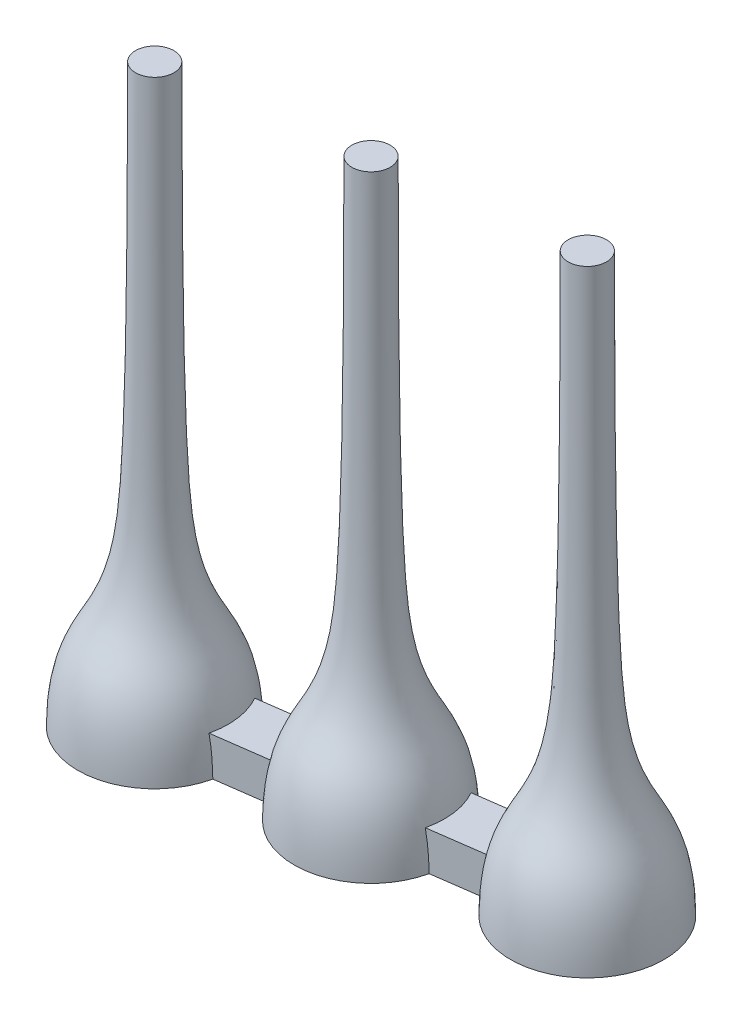
ISO-10303-21;
HEADER;
FILE_DESCRIPTION(('STEP AP214'),'2;1');
FILE_NAME('part.step','',(''),(''),'','','');
FILE_SCHEMA(('AUTOMOTIVE_DESIGN { 1 0 10303 214 1 1 1 1 }'));
ENDSEC;
DATA;
#1=APPLICATION_CONTEXT('core data for automotive mechanical design processes');
#2=APPLICATION_PROTOCOL_DEFINITION('international standard','automotive_design',2000,#1);
#3=PRODUCT_CONTEXT('',#1,'mechanical');
#4=PRODUCT('Part','Part','',(#3));
#5=PRODUCT_RELATED_PRODUCT_CATEGORY('part','',(#4));
#6=PRODUCT_DEFINITION_FORMATION('','',#4);
#7=PRODUCT_DEFINITION_CONTEXT('part definition',#1,'design');
#8=PRODUCT_DEFINITION('design','',#6,#7);
#9=PRODUCT_DEFINITION_SHAPE('','',#8);
#10=(LENGTH_UNIT() NAMED_UNIT(*) SI_UNIT(.MILLI.,.METRE.));
#11=(NAMED_UNIT(*) PLANE_ANGLE_UNIT() SI_UNIT($,.RADIAN.));
#12=(NAMED_UNIT(*) SI_UNIT($,.STERADIAN.) SOLID_ANGLE_UNIT());
#13=UNCERTAINTY_MEASURE_WITH_UNIT(LENGTH_MEASURE(1.E-05),#10,'distance_accuracy_value','');
#14=(GEOMETRIC_REPRESENTATION_CONTEXT(3) GLOBAL_UNCERTAINTY_ASSIGNED_CONTEXT((#13)) GLOBAL_UNIT_ASSIGNED_CONTEXT((#10,
#11,#12)) REPRESENTATION_CONTEXT('',''));
#15=CARTESIAN_POINT('',(0.,0.,0.));
#16=DIRECTION('',(0.,0.,1.));
#17=DIRECTION('',(1.,0.,0.));
#18=AXIS2_PLACEMENT_3D('',#15,#16,#17);
#19=CARTESIAN_POINT('',(5.04875421828556,0.5,0.00899129266223502));
#20=DIRECTION('',(0.136883934464053,0.,0.990587092832145));
#21=DIRECTION('',(0.990587092832145,0.,-0.136883934464053));
#22=AXIS2_PLACEMENT_3D('',#19,#20,#21);
#23=PLANE('',#22);
#24=DIRECTION('',(0.990587092832145,0.,-0.136883934464053));
#25=VECTOR('',#24,1.);
#26=CARTESIAN_POINT('',(0.0958187541248382,0.,0.693410964982502));
#27=LINE('',#26,#25);
#28=CARTESIAN_POINT('',(1.95168307771765,0.,0.436958995960229));
#29=VERTEX_POINT('',#28);
#30=CARTESIAN_POINT('',(3.19288989469275,0.,0.265443261684508));
#31=VERTEX_POINT('',#30);
#32=EDGE_CURVE('E57',#29,#31,#27,.T.);
#33=ORIENTED_EDGE('',*,*,#32,.T.);
#34=CARTESIAN_POINT('',(3.19288989469275,0.,0.265443261684506));
#35=CARTESIAN_POINT('',(3.19364951499609,0.0559071578506625,0.265338293815885));
#36=CARTESIAN_POINT('',(3.19493796129244,0.111810646118896,0.265160250310507));
#37=CARTESIAN_POINT('',(3.19872604671667,0.223492036276686,0.264636795037664));
#38=CARTESIAN_POINT('',(3.20122388324829,0.27927000134446,0.264291632361338));
#39=CARTESIAN_POINT('',(3.20758262378527,0.390695919564343,0.263412952001744));
#40=CARTESIAN_POINT('',(3.21144224084063,0.446343945705496,0.262879612155218));
#41=CARTESIAN_POINT('',(3.22071311753144,0.557525467446944,0.261598519269442));
#42=CARTESIAN_POINT('',(3.22612481647339,0.6130589261311,0.260850705524775));
#43=CARTESIAN_POINT('',(3.2387141348174,0.723962518008156,0.259111054928055));
#44=CARTESIAN_POINT('',(3.24589291845457,0.779332519069865,0.258119057196575));
#45=CARTESIAN_POINT('',(3.26226903911075,0.889870317923457,0.255856128633407));
#46=CARTESIAN_POINT('',(3.27147007471162,0.945037554416825,0.254584686714464));
#47=CARTESIAN_POINT('',(3.28179689169905,1.00000000000001,0.253157679084383));
#48=B_SPLINE_CURVE_WITH_KNOTS('',3,(#34,#35,#36,#37,#38,#39,#40,#41,#42,#43,#44,#45,#46,#47),
.UNSPECIFIED.,.F.,.F.,(4,2,2,2,2,2,4),(0.,0.167740107054638,0.335230963551968,0.5025639550106,
0.669944355786137,0.837435330879287,1.00523522488654),.UNSPECIFIED.);
#49=CARTESIAN_POINT('',(3.28179689169905,1.00000000000001,0.253157679084384));
#50=VERTEX_POINT('',#49);
#51=EDGE_CURVE('E211',#31,#50,#48,.T.);
#52=ORIENTED_EDGE('',*,*,#51,.T.);
#53=DIRECTION('',(-0.990587092832145,0.,0.136883934464053));
#54=VECTOR('',#53,1.);
#55=CARTESIAN_POINT('',(0.0958187541248382,1.,0.693410964982502));
#56=LINE('',#55,#54);
#57=CARTESIAN_POINT('',(1.86277608071135,1.00000000000001,0.449244578560353));
#58=VERTEX_POINT('',#57);
#59=EDGE_CURVE('E247',#50,#58,#56,.T.);
#60=ORIENTED_EDGE('',*,*,#59,.T.);
#61=CARTESIAN_POINT('',(1.95168307771765,0.,0.436958995960229));
#62=CARTESIAN_POINT('',(1.95092345741431,0.0559071578506622,0.437063963828851));
#63=CARTESIAN_POINT('',(1.94963501111796,0.111810646118895,0.437242007334229));
#64=CARTESIAN_POINT('',(1.94584692569373,0.223492036276684,0.437765462607074));
#65=CARTESIAN_POINT('',(1.94334908916211,0.279270001344457,0.4381106252834));
#66=CARTESIAN_POINT('',(1.93699034862513,0.390695919564339,0.438989305642993));
#67=CARTESIAN_POINT('',(1.93313073156977,0.446343945705491,0.439522645489519));
#68=CARTESIAN_POINT('',(1.92385985487897,0.557525467446938,0.440803738375295));
#69=CARTESIAN_POINT('',(1.91844815593701,0.613058926131093,0.441551552119962));
#70=CARTESIAN_POINT('',(1.905858837593,0.723962518008149,0.443291202716682));
#71=CARTESIAN_POINT('',(1.89868005395583,0.779332519069857,0.444283200448162));
#72=CARTESIAN_POINT('',(1.88230393329965,0.889870317923447,0.446546129011331));
#73=CARTESIAN_POINT('',(1.87310289769878,0.945037554416814,0.447817570930273));
#74=CARTESIAN_POINT('',(1.86277608071135,1.,0.449244578560353));
#75=B_SPLINE_CURVE_WITH_KNOTS('',3,(#61,#62,#63,#64,#65,#66,#67,#68,#69,#70,#71,#72,#73,#74),
.UNSPECIFIED.,.F.,.F.,(4,2,2,2,2,2,4),(0.,0.167740107054636,0.335230963551964,0.502563955010594,
0.669944355786129,0.837435330879277,1.00523522488653),.UNSPECIFIED.);
#76=EDGE_CURVE('E134',#29,#58,#75,.T.);
#77=ORIENTED_EDGE('',*,*,#76,.F.);
#78=EDGE_LOOP('',(#33,#52,#60,#77));
#79=FACE_BOUND('',#78,.T.);
#80=ADVANCED_FACE('F34',(#79),#23,.T.);
#81=CARTESIAN_POINT('',(8.23473235585978,1.00000000000001,-0.431261993235883));
#82=VERTEX_POINT('',#81);
#83=CARTESIAN_POINT('',(6.81571154487207,1.00000000000001,-0.235175093759914));
#84=VERTEX_POINT('',#83);
#85=EDGE_CURVE('E163',#82,#84,#56,.T.);
#86=ORIENTED_EDGE('',*,*,#85,.T.);
#87=CARTESIAN_POINT('',(6.81571154487207,1.00000000000001,-0.235175093759914));
#88=CARTESIAN_POINT('',(6.82603836185951,0.945037554416825,-0.236602101389994));
#89=CARTESIAN_POINT('',(6.83523939746037,0.889870317923457,-0.237873543308937));
#90=CARTESIAN_POINT('',(6.85161551811655,0.779332519069865,-0.240136471872105));
#91=CARTESIAN_POINT('',(6.85879430175373,0.723962518008156,-0.241128469603585));
#92=CARTESIAN_POINT('',(6.87138362009774,0.6130589261311,-0.242868120200305));
#93=CARTESIAN_POINT('',(6.87679531903969,0.557525467446944,-0.243615933944972));
#94=CARTESIAN_POINT('',(6.88606619573049,0.446343945705496,-0.244897026830747));
#95=CARTESIAN_POINT('',(6.88992581278585,0.390695919564343,-0.245430366677274));
#96=CARTESIAN_POINT('',(6.89628455332284,0.27927000134446,-0.246309047036868));
#97=CARTESIAN_POINT('',(6.89878238985446,0.223492036276686,-0.246654209713194));
#98=CARTESIAN_POINT('',(6.90257047527869,0.111810646118896,-0.247177664986038));
#99=CARTESIAN_POINT('',(6.90385892157504,0.055907157850663,-0.247355708491415));
#100=CARTESIAN_POINT('',(6.90461854187837,0.,-0.247460676360036));
#101=B_SPLINE_CURVE_WITH_KNOTS('',3,(#87,#88,#89,#90,#91,#92,#93,#94,#95,#96,#97,#98,#99,#100),
.UNSPECIFIED.,.F.,.F.,(4,2,2,2,2,2,4),(0.,0.16779989400725,0.3352908691004,0.502671269875937,
0.670004261334568,0.837495117831899,1.00523522488654),.UNSPECIFIED.);
#102=CARTESIAN_POINT('',(6.90461854187837,0.,-0.247460676360038));
#103=VERTEX_POINT('',#102);
#104=EDGE_CURVE('E49',#84,#103,#101,.T.);
#105=ORIENTED_EDGE('',*,*,#104,.T.);
#106=CARTESIAN_POINT('',(8.14582535885348,0.,-0.418976410635759));
#107=VERTEX_POINT('',#106);
#108=EDGE_CURVE('E248',#103,#107,#27,.T.);
#109=ORIENTED_EDGE('',*,*,#108,.T.);
#110=CARTESIAN_POINT('',(8.14582535885348,0.,-0.418976410635759));
#111=CARTESIAN_POINT('',(8.14658497915682,0.0559071578506622,-0.419081378504381));
#112=CARTESIAN_POINT('',(8.14787342545317,0.111810646118895,-0.41925942200976));
#113=CARTESIAN_POINT('',(8.15166151087739,0.223492036276684,-0.419782877282604));
#114=CARTESIAN_POINT('',(8.15415934740901,0.279270001344457,-0.420128039958929));
#115=CARTESIAN_POINT('',(8.16051808794599,0.390695919564339,-0.421006720318522));
#116=CARTESIAN_POINT('',(8.16437770500135,0.446343945705492,-0.421540060165049));
#117=CARTESIAN_POINT('',(8.17364858169215,0.557525467446939,-0.422821153050824));
#118=CARTESIAN_POINT('',(8.17906028063411,0.613058926131094,-0.423568966795491));
#119=CARTESIAN_POINT('',(8.19164959897812,0.723962518008149,-0.425308617392212));
#120=CARTESIAN_POINT('',(8.1988283826153,0.779332519069857,-0.426300615123692));
#121=CARTESIAN_POINT('',(8.21520450327148,0.889870317923447,-0.428563543686861));
#122=CARTESIAN_POINT('',(8.22440553887235,0.945037554416815,-0.429834985605804));
#123=CARTESIAN_POINT('',(8.23473235585978,1.,-0.431261993235885));
#124=B_SPLINE_CURVE_WITH_KNOTS('',3,(#110,#111,#112,#113,#114,#115,#116,#117,#118,#119,#120,
#121,#122,#123),.UNSPECIFIED.,.F.,.F.,(4,2,2,2,2,2,4),(0.,0.167740107054636,0.335230963551965,
0.502563955010595,0.66994435578613,0.837435330879278,1.00523522488653),.UNSPECIFIED.);
#125=EDGE_CURVE('E238',#107,#82,#124,.T.);
#126=ORIENTED_EDGE('',*,*,#125,.T.);
#127=EDGE_LOOP('',(#86,#105,#109,#126));
#128=FACE_BOUND('',#127,.T.);
#129=ADVANCED_FACE('F169',(#128),#23,.T.);
#130=CARTESIAN_POINT('',(4.85711671003589,0.5,-1.37783063730277));
#131=DIRECTION('',(0.136883934464053,0.,0.990587092832145));
#132=DIRECTION('',(0.990587092832145,0.,-0.136883934464053));
#133=AXIS2_PLACEMENT_3D('',#130,#131,#132);
#134=PLANE('',#133);
#135=CARTESIAN_POINT('',(3.00125238644307,0.,-1.12137866828049));
#136=CARTESIAN_POINT('',(3.00201200674641,0.0559071578506614,-1.12148363614911));
#137=CARTESIAN_POINT('',(3.00330045304276,0.111810646118894,-1.12166167965449));
#138=CARTESIAN_POINT('',(3.007088538467,0.223492036276681,-1.12218513492734));
#139=CARTESIAN_POINT('',(3.00958637499861,0.279270001344454,-1.12253029760367));
#140=CARTESIAN_POINT('',(3.0159451155356,0.390695919564335,-1.12340897796326));
#141=CARTESIAN_POINT('',(3.01980473259095,0.446343945705487,-1.12394231780979));
#142=CARTESIAN_POINT('',(3.02907560928176,0.557525467446933,-1.12522341069556));
#143=CARTESIAN_POINT('',(3.03448730822371,0.613058926131087,-1.12597122444023));
#144=CARTESIAN_POINT('',(3.04707662656772,0.723962518008142,-1.12771087503695));
#145=CARTESIAN_POINT('',(3.0542554102049,0.77933251906985,-1.12870287276843));
#146=CARTESIAN_POINT('',(3.07063153086108,0.889870317923439,-1.1309658013316));
#147=CARTESIAN_POINT('',(3.07983256646194,0.945037554416807,-1.13223724325054));
#148=CARTESIAN_POINT('',(3.09015938344938,0.999999999999992,-1.13366425088062));
#149=B_SPLINE_CURVE_WITH_KNOTS('',3,(#135,#136,#137,#138,#139,#140,#141,#142,#143,#144,#145,
#146,#147,#148),.UNSPECIFIED.,.F.,.F.,(4,2,2,2,2,2,4),(0.,0.167740107054634,0.335230963551961,
0.50256395501059,0.669944355786123,0.83743533087927,1.00523522488652),.UNSPECIFIED.);
#150=CARTESIAN_POINT('',(3.00125238644308,0.,-1.12137866828049));
#151=VERTEX_POINT('',#150);
#152=CARTESIAN_POINT('',(3.09015938344938,1.00000000000001,-1.13366425088062));
#153=VERTEX_POINT('',#152);
#154=EDGE_CURVE('E217',#151,#153,#149,.T.);
#155=ORIENTED_EDGE('',*,*,#154,.F.);
#156=DIRECTION('',(0.990587092832145,0.,-0.136883934464053));
#157=VECTOR('',#156,1.);
#158=CARTESIAN_POINT('',(-0.0958187541248373,0.,-0.693410964982501));
#159=LINE('',#158,#157);
#160=CARTESIAN_POINT('',(1.76004556946797,0.,-0.949862934004774));
#161=VERTEX_POINT('',#160);
#162=EDGE_CURVE('E245',#161,#151,#159,.T.);
#163=ORIENTED_EDGE('',*,*,#162,.F.);
#164=CARTESIAN_POINT('',(1.76004556946797,0.,-0.949862934004775));
#165=CARTESIAN_POINT('',(1.75928594916464,0.0559071578506622,-0.949757966136152));
#166=CARTESIAN_POINT('',(1.75799750286829,0.111810646118895,-0.949579922630774));
#167=CARTESIAN_POINT('',(1.75420941744406,0.223492036276683,-0.949056467357929));
#168=CARTESIAN_POINT('',(1.75171158091244,0.279270001344457,-0.948711304681604));
#169=CARTESIAN_POINT('',(1.74535284037546,0.390695919564339,-0.94783262432201));
#170=CARTESIAN_POINT('',(1.7414932233201,0.446343945705491,-0.947299284475484));
#171=CARTESIAN_POINT('',(1.73222234662929,0.557525467446938,-0.946018191589708));
#172=CARTESIAN_POINT('',(1.72681064768734,0.613058926131093,-0.945270377845042));
#173=CARTESIAN_POINT('',(1.71422132934333,0.723962518008149,-0.943530727248321));
#174=CARTESIAN_POINT('',(1.70704254570615,0.779332519069857,-0.942538729516841));
#175=CARTESIAN_POINT('',(1.69066642504997,0.889870317923447,-0.940275800953673));
#176=CARTESIAN_POINT('',(1.68146538944911,0.945037554416814,-0.93900435903473));
#177=CARTESIAN_POINT('',(1.67113857246167,1.,-0.937577351404651));
#178=B_SPLINE_CURVE_WITH_KNOTS('',3,(#164,#165,#166,#167,#168,#169,#170,#171,#172,#173,#174,
#175,#176,#177),.UNSPECIFIED.,.F.,.F.,(4,2,2,2,2,2,4),(0.,0.167740107054636,0.335230963551964,
0.502563955010594,0.669944355786129,0.837435330879277,1.00523522488653),.UNSPECIFIED.);
#179=CARTESIAN_POINT('',(1.67113857246167,1.,-0.93757735140465));
#180=VERTEX_POINT('',#179);
#181=EDGE_CURVE('E155',#161,#180,#178,.T.);
#182=ORIENTED_EDGE('',*,*,#181,.T.);
#183=DIRECTION('',(-0.990587092832145,0.,0.136883934464053));
#184=VECTOR('',#183,1.);
#185=CARTESIAN_POINT('',(-0.0958187541248373,1.,-0.693410964982501));
#186=LINE('',#185,#184);
#187=EDGE_CURVE('E110',#153,#180,#186,.T.);
#188=ORIENTED_EDGE('',*,*,#187,.F.);
#189=EDGE_LOOP('',(#155,#163,#182,#188));
#190=FACE_BOUND('',#189,.T.);
#191=ADVANCED_FACE('F165',(#190),#134,.F.);
#192=CARTESIAN_POINT('',(6.6240740366224,1.00000000000001,-1.62199702372492));
#193=CARTESIAN_POINT('',(6.63440085360983,0.945037554416825,-1.623424031355));
#194=CARTESIAN_POINT('',(6.6436018892107,0.889870317923457,-1.62469547327394));
#195=CARTESIAN_POINT('',(6.65997800986688,0.779332519069866,-1.62695840183711));
#196=CARTESIAN_POINT('',(6.66715679350405,0.723962518008157,-1.62795039956859));
#197=CARTESIAN_POINT('',(6.67974611184806,0.6130589261311,-1.62969005016531));
#198=CARTESIAN_POINT('',(6.68515781079002,0.557525467446944,-1.63043786390998));
#199=CARTESIAN_POINT('',(6.69442868748082,0.446343945705496,-1.63171895679575));
#200=CARTESIAN_POINT('',(6.69828830453618,0.390695919564343,-1.63225229664228));
#201=CARTESIAN_POINT('',(6.70464704507316,0.27927000134446,-1.63313097700187));
#202=CARTESIAN_POINT('',(6.70714488160478,0.223492036276686,-1.6334761396782));
#203=CARTESIAN_POINT('',(6.71093296702901,0.111810646118896,-1.63399959495104));
#204=CARTESIAN_POINT('',(6.71222141332537,0.055907157850663,-1.63417763845642));
#205=CARTESIAN_POINT('',(6.7129810336287,0.,-1.63428260632504));
#206=B_SPLINE_CURVE_WITH_KNOTS('',3,(#192,#193,#194,#195,#196,#197,#198,#199,#200,#201,#202,
#203,#204,#205),.UNSPECIFIED.,.F.,.F.,(4,2,2,2,2,2,4),(0.,0.16779989400725,0.3352908691004,
0.502671269875937,0.670004261334568,0.837495117831899,1.00523522488654),.UNSPECIFIED.);
#207=CARTESIAN_POINT('',(6.6240740366224,1.00000000000001,-1.62199702372492));
#208=VERTEX_POINT('',#207);
#209=CARTESIAN_POINT('',(6.7129810336287,0.,-1.63428260632504));
#210=VERTEX_POINT('',#209);
#211=EDGE_CURVE('E113',#208,#210,#206,.T.);
#212=ORIENTED_EDGE('',*,*,#211,.F.);
#213=CARTESIAN_POINT('',(8.0430948476101,1.00000000000001,-1.81808392320089));
#214=VERTEX_POINT('',#213);
#215=EDGE_CURVE('E100',#214,#208,#186,.T.);
#216=ORIENTED_EDGE('',*,*,#215,.F.);
#217=CARTESIAN_POINT('',(7.9541878506038,0.,-1.80579834060076));
#218=CARTESIAN_POINT('',(7.95494747090713,0.0559071578506623,-1.80590330846938));
#219=CARTESIAN_POINT('',(7.95623591720349,0.111810646118895,-1.80608135197476));
#220=CARTESIAN_POINT('',(7.96002400262772,0.223492036276684,-1.80660480724761));
#221=CARTESIAN_POINT('',(7.96252183915934,0.279270001344457,-1.80694996992393));
#222=CARTESIAN_POINT('',(7.96888057969632,0.390695919564339,-1.80782865028353));
#223=CARTESIAN_POINT('',(7.97274019675168,0.446343945705491,-1.80836199013005));
#224=CARTESIAN_POINT('',(7.98201107344249,0.557525467446938,-1.80964308301583));
#225=CARTESIAN_POINT('',(7.98742277238444,0.613058926131094,-1.81039089676049));
#226=CARTESIAN_POINT('',(8.00001209072845,0.723962518008149,-1.81213054735721));
#227=CARTESIAN_POINT('',(8.00719087436562,0.779332519069858,-1.81312254508869));
#228=CARTESIAN_POINT('',(8.0235669950218,0.889870317923448,-1.81538547365186));
#229=CARTESIAN_POINT('',(8.03276803062267,0.945037554416816,-1.81665691557081));
#230=CARTESIAN_POINT('',(8.0430948476101,1.,-1.81808392320089));
#231=B_SPLINE_CURVE_WITH_KNOTS('',3,(#217,#218,#219,#220,#221,#222,#223,#224,#225,#226,#227,
#228,#229,#230),.UNSPECIFIED.,.F.,.F.,(4,2,2,2,2,2,4),(0.,0.167740107054636,0.335230963551965,
0.502563955010595,0.66994435578613,0.837435330879278,1.00523522488653),.UNSPECIFIED.);
#232=CARTESIAN_POINT('',(7.9541878506038,0.,-1.80579834060076));
#233=VERTEX_POINT('',#232);
#234=EDGE_CURVE('E178',#233,#214,#231,.T.);
#235=ORIENTED_EDGE('',*,*,#234,.F.);
#236=EDGE_CURVE('E109',#210,#233,#159,.T.);
#237=ORIENTED_EDGE('',*,*,#236,.F.);
#238=EDGE_LOOP('',(#212,#216,#235,#237));
#239=FACE_BOUND('',#238,.T.);
#240=ADVANCED_FACE('F114',(#239),#134,.F.);
#241=CARTESIAN_POINT('',(0.136883934464054,1.,0.990587092832146));
#242=DIRECTION('',(0.,-1.,0.));
#243=DIRECTION('',(-0.136883934464053,0.,-0.990587092832145));
#244=AXIS2_PLACEMENT_3D('',#241,#242,#243);
#245=PLANE('',#244);
#246=CARTESIAN_POINT('',(4.95293546416073,1.00000000000001,-0.684419672320267));
#247=DIRECTION('',(0.,1.,0.));
#248=DIRECTION('',(-1.,0.,0.));
#249=AXIS2_PLACEMENT_3D('',#246,#247,#248);
#250=CIRCLE('',#249,1.91618251172382);
#251=EDGE_CURVE('E11',#153,#50,#250,.T.);
#252=ORIENTED_EDGE('',*,*,#251,.F.);
#253=ORIENTED_EDGE('',*,*,#187,.T.);
#254=CARTESIAN_POINT('',(0.,1.00000000000001,0.));
#255=DIRECTION('',(0.,1.,0.));
#256=DIRECTION('',(0.,0.,1.));
#257=AXIS2_PLACEMENT_3D('',#254,#255,#256);
#258=CIRCLE('',#257,1.91618251172382);
#259=EDGE_CURVE('E123',#180,#58,#258,.F.);
#260=ORIENTED_EDGE('',*,*,#259,.T.);
#261=ORIENTED_EDGE('',*,*,#59,.F.);
#262=EDGE_LOOP('',(#252,#253,#260,#261));
#263=FACE_BOUND('',#262,.T.);
#264=ADVANCED_FACE('F254',(#263),#245,.F.);
#265=CARTESIAN_POINT('',(0.,15.,0.));
#266=DIRECTION('',(0.,-1.,0.));
#267=DIRECTION('',(0.,0.,-1.));
#268=AXIS2_PLACEMENT_3D('',#265,#266,#267);
#269=PLANE('',#268);
#270=CARTESIAN_POINT('',(0.,15.,0.));
#271=DIRECTION('',(0.,1.,0.));
#272=DIRECTION('',(0.,0.,1.));
#273=AXIS2_PLACEMENT_3D('',#270,#271,#272);
#274=CIRCLE('',#273,0.5);
#275=CARTESIAN_POINT('',(0.,15.,0.5));
#276=VERTEX_POINT('',#275);
#277=EDGE_CURVE('E127',#276,#276,#274,.T.);
#278=ORIENTED_EDGE('',*,*,#277,.T.);
#279=EDGE_LOOP('',(#278));
#280=FACE_BOUND('',#279,.T.);
#281=ADVANCED_FACE('F36',(#280),#269,.F.);
#282=CARTESIAN_POINT('',(2.,0.,0.));
#283=CARTESIAN_POINT('',(1.96995028212624,2.3514531969424,0.));
#284=CARTESIAN_POINT('',(0.941978143292364,2.03355611013739,0.));
#285=CARTESIAN_POINT('',(0.571405700022448,5.99492601884955,0.));
#286=CARTESIAN_POINT('',(0.501667506782302,9.66079199707474,0.));
#287=CARTESIAN_POINT('',(0.5,15.,0.));
#288=B_SPLINE_CURVE_WITH_KNOTS('',3,(#282,#283,#284,#285,#286,#287),.UNSPECIFIED.,.F.,.F.,(4,1,
1,4),(0.,0.669768410961681,0.769768410961681,1.),.UNSPECIFIED.);
#289=CARTESIAN_POINT('',(0.,15.,0.));
#290=DIRECTION('',(0.,1.,0.));
#291=AXIS1_PLACEMENT('',#289,#290);
#292=SURFACE_OF_REVOLUTION('',#288,#291);
#293=CARTESIAN_POINT('',(0.,0.,0.));
#294=DIRECTION('',(0.,1.,0.));
#295=DIRECTION('',(0.,0.,1.));
#296=AXIS2_PLACEMENT_3D('',#293,#294,#295);
#297=CIRCLE('',#296,2.);
#298=EDGE_CURVE('E132',#161,#29,#297,.T.);
#299=ORIENTED_EDGE('',*,*,#298,.T.);
#300=ORIENTED_EDGE('',*,*,#76,.T.);
#301=ORIENTED_EDGE('',*,*,#259,.F.);
#302=ORIENTED_EDGE('',*,*,#181,.F.);
#303=EDGE_LOOP('',(#299,#300,#301,#302));
#304=FACE_BOUND('',#303,.T.);
#305=ORIENTED_EDGE('',*,*,#277,.F.);
#306=EDGE_LOOP('',(#305));
#307=FACE_BOUND('',#306,.T.);
#308=ADVANCED_FACE('F148',(#304,#307),#292,.T.);
#309=CARTESIAN_POINT('',(0.,0.,0.));
#310=DIRECTION('',(0.,1.,0.));
#311=DIRECTION('',(0.,0.,1.));
#312=AXIS2_PLACEMENT_3D('',#309,#310,#311);
#313=PLANE('',#312);
#314=ORIENTED_EDGE('',*,*,#162,.T.);
#315=CARTESIAN_POINT('',(4.95293546416073,0.,-0.684419672320267));
#316=DIRECTION('',(0.,1.,0.));
#317=DIRECTION('',(5.15378961729596E-10,0.,1.));
#318=AXIS2_PLACEMENT_3D('',#315,#316,#317);
#319=CIRCLE('',#318,2.);
#320=EDGE_CURVE('E118',#210,#151,#319,.T.);
#321=ORIENTED_EDGE('',*,*,#320,.F.);
#322=ORIENTED_EDGE('',*,*,#236,.T.);
#323=CARTESIAN_POINT('',(9.90587092832145,0.,-1.36883934464053));
#324=DIRECTION('',(0.,1.,0.));
#325=DIRECTION('',(-0.18050051256071,0.,0.983574890369473));
#326=AXIS2_PLACEMENT_3D('',#323,#324,#325);
#327=CIRCLE('',#326,2.);
#328=EDGE_CURVE('E223',#107,#233,#327,.T.);
#329=ORIENTED_EDGE('',*,*,#328,.F.);
#330=ORIENTED_EDGE('',*,*,#108,.F.);
#331=EDGE_CURVE('E259',#31,#103,#319,.T.);
#332=ORIENTED_EDGE('',*,*,#331,.F.);
#333=ORIENTED_EDGE('',*,*,#32,.F.);
#334=ORIENTED_EDGE('',*,*,#298,.F.);
#335=EDGE_LOOP('',(#314,#321,#322,#329,#330,#332,#333,#334));
#336=FACE_BOUND('',#335,.T.);
#337=ADVANCED_FACE('F152',(#336),#313,.F.);
#338=EDGE_CURVE('E38',#84,#208,#250,.T.);
#339=ORIENTED_EDGE('',*,*,#338,.F.);
#340=ORIENTED_EDGE('',*,*,#85,.F.);
#341=CARTESIAN_POINT('',(9.90587092832145,1.00000000000001,-1.36883934464053));
#342=DIRECTION('',(0.,1.,0.));
#343=DIRECTION('',(-1.,0.,0.));
#344=AXIS2_PLACEMENT_3D('',#341,#342,#343);
#345=CIRCLE('',#344,1.91618251172382);
#346=EDGE_CURVE('E105',#214,#82,#345,.T.);
#347=ORIENTED_EDGE('',*,*,#346,.F.);
#348=ORIENTED_EDGE('',*,*,#215,.T.);
#349=EDGE_LOOP('',(#339,#340,#347,#348));
#350=FACE_BOUND('',#349,.T.);
#351=ADVANCED_FACE('F102',(#350),#245,.F.);
#352=CARTESIAN_POINT('',(9.90587092832145,15.,-1.36883934464053));
#353=DIRECTION('',(0.,-1.,0.));
#354=DIRECTION('',(0.18050051256071,0.,-0.983574890369473));
#355=AXIS2_PLACEMENT_3D('',#352,#353,#354);
#356=PLANE('',#355);
#357=CARTESIAN_POINT('',(9.90587092832145,15.,-1.36883934464053));
#358=DIRECTION('',(0.,1.,0.));
#359=DIRECTION('',(-0.18050051256071,0.,0.983574890369473));
#360=AXIS2_PLACEMENT_3D('',#357,#358,#359);
#361=CIRCLE('',#360,0.5);
#362=CARTESIAN_POINT('',(9.8156206720411,15.,-0.877051899455797));
#363=VERTEX_POINT('',#362);
#364=EDGE_CURVE('E226',#363,#363,#361,.T.);
#365=ORIENTED_EDGE('',*,*,#364,.T.);
#366=EDGE_LOOP('',(#365));
#367=FACE_BOUND('',#366,.T.);
#368=ADVANCED_FACE('F309',(#367),#356,.F.);
#369=CARTESIAN_POINT('',(11.8730207090604,0.,-1.00783831951911));
#370=CARTESIAN_POINT('',(11.8434645610971,2.3514531969424,-1.01326230899763));
#371=CARTESIAN_POINT('',(10.8323769773407,2.03355611013739,-1.19881180695528));
#372=CARTESIAN_POINT('',(10.4678912270775,5.99492601884955,-1.26570032290637));
#373=CARTESIAN_POINT('',(10.3992984913068,9.66079199707474,-1.27828810253127));
#374=CARTESIAN_POINT('',(10.3976583735062,15.,-1.27858908836018));
#375=B_SPLINE_CURVE_WITH_KNOTS('',3,(#369,#370,#371,#372,#373,#374),.UNSPECIFIED.,.F.,.F.,(4,1,
1,4),(0.,0.669768410961681,0.769768410961681,1.),.UNSPECIFIED.);
#376=CARTESIAN_POINT('',(9.90587092832145,15.,-1.36883934464053));
#377=DIRECTION('',(0.,1.,0.));
#378=AXIS1_PLACEMENT('',#376,#377);
#379=SURFACE_OF_REVOLUTION('',#375,#378);
#380=ORIENTED_EDGE('',*,*,#125,.F.);
#381=ORIENTED_EDGE('',*,*,#328,.T.);
#382=ORIENTED_EDGE('',*,*,#234,.T.);
#383=ORIENTED_EDGE('',*,*,#346,.T.);
#384=EDGE_LOOP('',(#380,#381,#382,#383));
#385=FACE_BOUND('',#384,.T.);
#386=ORIENTED_EDGE('',*,*,#364,.F.);
#387=EDGE_LOOP('',(#386));
#388=FACE_BOUND('',#387,.T.);
#389=ADVANCED_FACE('F205',(#385,#388),#379,.T.);
#390=CARTESIAN_POINT('',(6.95293546416073,0.,-0.684419673351024));
#391=CARTESIAN_POINT('',(6.92288574628697,2.3514531969424,-0.684419673335538));
#392=CARTESIAN_POINT('',(5.89491360745309,2.03355611013739,-0.684419672805742));
#393=CARTESIAN_POINT('',(5.52434116418317,5.99492601884955,-0.684419672614757));
#394=CARTESIAN_POINT('',(5.45460297094303,9.66079199707474,-0.684419672578816));
#395=CARTESIAN_POINT('',(5.45293546416073,15.,-0.684419672577956));
#396=B_SPLINE_CURVE_WITH_KNOTS('',3,(#390,#391,#392,#393,#394,#395),.UNSPECIFIED.,.F.,.F.,(4,1,
1,4),(0.,0.669768410961681,0.769768410961681,1.),.UNSPECIFIED.);
#397=CARTESIAN_POINT('',(4.95293546416073,15.,-0.684419672320267));
#398=DIRECTION('',(0.,1.,0.));
#399=AXIS1_PLACEMENT('',#397,#398);
#400=SURFACE_OF_REVOLUTION('',#396,#399);
#401=ORIENTED_EDGE('',*,*,#51,.F.);
#402=ORIENTED_EDGE('',*,*,#331,.T.);
#403=ORIENTED_EDGE('',*,*,#104,.F.);
#404=ORIENTED_EDGE('',*,*,#338,.T.);
#405=ORIENTED_EDGE('',*,*,#211,.T.);
#406=ORIENTED_EDGE('',*,*,#320,.T.);
#407=ORIENTED_EDGE('',*,*,#154,.T.);
#408=ORIENTED_EDGE('',*,*,#251,.T.);
#409=EDGE_LOOP('',(#401,#402,#403,#404,#405,#406,#407,#408));
#410=FACE_BOUND('',#409,.T.);
#411=CARTESIAN_POINT('',(4.95293546416073,15.,-0.684419672320267));
#412=DIRECTION('',(0.,1.,0.));
#413=DIRECTION('',(5.15378961729596E-10,0.,1.));
#414=AXIS2_PLACEMENT_3D('',#411,#412,#413);
#415=CIRCLE('',#414,0.5);
#416=CARTESIAN_POINT('',(4.95293546441842,15.,-0.184419672320267));
#417=VERTEX_POINT('',#416);
#418=EDGE_CURVE('E260',#417,#417,#415,.T.);
#419=ORIENTED_EDGE('',*,*,#418,.F.);
#420=EDGE_LOOP('',(#419));
#421=FACE_BOUND('',#420,.T.);
#422=ADVANCED_FACE('F120',(#410,#421),#400,.T.);
#423=CARTESIAN_POINT('',(4.95293546416073,15.,-0.684419672320267));
#424=DIRECTION('',(0.,-1.,0.));
#425=DIRECTION('',(-5.15378961729596E-10,0.,-1.));
#426=AXIS2_PLACEMENT_3D('',#423,#424,#425);
#427=PLANE('',#426);
#428=ORIENTED_EDGE('',*,*,#418,.T.);
#429=EDGE_LOOP('',(#428));
#430=FACE_BOUND('',#429,.T.);
#431=ADVANCED_FACE('F204',(#430),#427,.F.);
#432=CLOSED_SHELL('',(#80,#129,#191,#240,#264,#281,#308,#337,#351,#368,#389,#422,#431));
#433=MANIFOLD_SOLID_BREP('B2',#432);
#434=ADVANCED_BREP_SHAPE_REPRESENTATION('',(#18,#433),#14);
#435=SHAPE_DEFINITION_REPRESENTATION(#9,#434);
ENDSEC;
END-ISO-10303-21;
